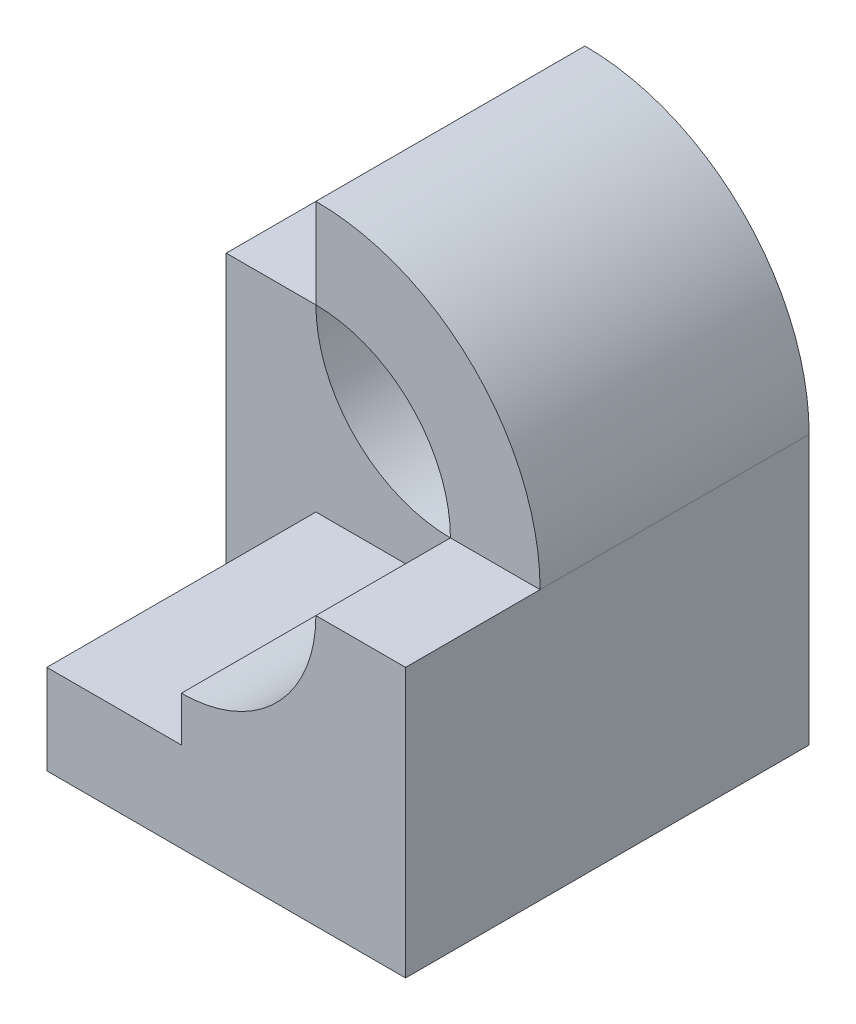
ISO-10303-21;
HEADER;
FILE_DESCRIPTION(('STEP AP214'),'2;1');
FILE_NAME('part.step','',(''),(''),'','','');
FILE_SCHEMA(('AUTOMOTIVE_DESIGN { 1 0 10303 214 1 1 1 1 }'));
ENDSEC;
DATA;
#1=APPLICATION_CONTEXT('core data for automotive mechanical design processes');
#2=APPLICATION_PROTOCOL_DEFINITION('international standard','automotive_design',2000,#1);
#3=PRODUCT_CONTEXT('',#1,'mechanical');
#4=PRODUCT('Part','Part','',(#3));
#5=PRODUCT_RELATED_PRODUCT_CATEGORY('part','',(#4));
#6=PRODUCT_DEFINITION_FORMATION('','',#4);
#7=PRODUCT_DEFINITION_CONTEXT('part definition',#1,'design');
#8=PRODUCT_DEFINITION('design','',#6,#7);
#9=PRODUCT_DEFINITION_SHAPE('','',#8);
#10=(LENGTH_UNIT() NAMED_UNIT(*) SI_UNIT(.MILLI.,.METRE.));
#11=(NAMED_UNIT(*) PLANE_ANGLE_UNIT() SI_UNIT($,.RADIAN.));
#12=(NAMED_UNIT(*) SI_UNIT($,.STERADIAN.) SOLID_ANGLE_UNIT());
#13=UNCERTAINTY_MEASURE_WITH_UNIT(LENGTH_MEASURE(1.E-05),#10,'distance_accuracy_value','');
#14=(GEOMETRIC_REPRESENTATION_CONTEXT(3) GLOBAL_UNCERTAINTY_ASSIGNED_CONTEXT((#13)) GLOBAL_UNIT_ASSIGNED_CONTEXT((#10,
#11,#12)) REPRESENTATION_CONTEXT('',''));
#15=CARTESIAN_POINT('',(0.,0.,0.));
#16=DIRECTION('',(0.,0.,1.));
#17=DIRECTION('',(1.,0.,0.));
#18=AXIS2_PLACEMENT_3D('',#15,#16,#17);
#19=CARTESIAN_POINT('',(5.,6.,9.));
#20=DIRECTION('',(0.,0.,-1.));
#21=DIRECTION('',(-1.,0.,0.));
#22=AXIS2_PLACEMENT_3D('',#19,#20,#21);
#23=CYLINDRICAL_SURFACE('',#22,5.);
#24=CARTESIAN_POINT('',(5.,6.,6.));
#25=DIRECTION('',(0.,0.,1.));
#26=DIRECTION('',(1.,0.,0.));
#27=AXIS2_PLACEMENT_3D('',#24,#25,#26);
#28=CIRCLE('',#27,5.);
#29=CARTESIAN_POINT('',(10.,6.,6.));
#30=VERTEX_POINT('',#29);
#31=CARTESIAN_POINT('',(4.99999999999998,11.,6.));
#32=VERTEX_POINT('',#31);
#33=EDGE_CURVE('E198',#30,#32,#28,.T.);
#34=ORIENTED_EDGE('',*,*,#33,.F.);
#35=DIRECTION('',(0.,0.,-1.));
#36=VECTOR('',#35,1.);
#37=CARTESIAN_POINT('',(10.,6.,9.));
#38=LINE('',#37,#36);
#39=CARTESIAN_POINT('',(10.,6.,0.));
#40=VERTEX_POINT('',#39);
#41=EDGE_CURVE('E168',#30,#40,#38,.T.);
#42=ORIENTED_EDGE('',*,*,#41,.T.);
#43=CARTESIAN_POINT('',(5.,6.,0.));
#44=DIRECTION('',(0.,0.,1.));
#45=DIRECTION('',(1.,0.,0.));
#46=AXIS2_PLACEMENT_3D('',#43,#44,#45);
#47=CIRCLE('',#46,5.);
#48=CARTESIAN_POINT('',(5.,11.,0.));
#49=VERTEX_POINT('',#48);
#50=EDGE_CURVE('E196',#40,#49,#47,.T.);
#51=ORIENTED_EDGE('',*,*,#50,.T.);
#52=DIRECTION('',(0.,0.,-1.));
#53=VECTOR('',#52,1.);
#54=CARTESIAN_POINT('',(5.,11.,9.));
#55=LINE('',#54,#53);
#56=EDGE_CURVE('E166',#32,#49,#55,.T.);
#57=ORIENTED_EDGE('',*,*,#56,.F.);
#58=EDGE_LOOP('',(#34,#42,#51,#57));
#59=FACE_BOUND('',#58,.T.);
#60=ADVANCED_FACE('F35',(#59),#23,.T.);
#61=CARTESIAN_POINT('',(5.,0.,9.));
#62=DIRECTION('',(1.,0.,0.));
#63=DIRECTION('',(0.,0.,-1.));
#64=AXIS2_PLACEMENT_3D('',#61,#62,#63);
#65=PLANE('',#64);
#66=DIRECTION('',(0.,-1.,0.));
#67=VECTOR('',#66,1.);
#68=CARTESIAN_POINT('',(4.99999999999998,11.,6.));
#69=LINE('',#68,#67);
#70=CARTESIAN_POINT('',(4.99999999999998,9.,6.));
#71=VERTEX_POINT('',#70);
#72=EDGE_CURVE('E225',#32,#71,#69,.T.);
#73=ORIENTED_EDGE('',*,*,#72,.F.);
#74=ORIENTED_EDGE('',*,*,#56,.T.);
#75=DIRECTION('',(0.,-1.,0.));
#76=VECTOR('',#75,1.);
#77=CARTESIAN_POINT('',(5.,0.,0.));
#78=LINE('',#77,#76);
#79=CARTESIAN_POINT('',(5.,9.,0.));
#80=VERTEX_POINT('',#79);
#81=EDGE_CURVE('E203',#49,#80,#78,.T.);
#82=ORIENTED_EDGE('',*,*,#81,.T.);
#83=DIRECTION('',(0.,0.,-1.));
#84=VECTOR('',#83,1.);
#85=CARTESIAN_POINT('',(5.,9.,9.));
#86=LINE('',#85,#84);
#87=EDGE_CURVE('E164',#71,#80,#86,.T.);
#88=ORIENTED_EDGE('',*,*,#87,.F.);
#89=EDGE_LOOP('',(#73,#74,#82,#88));
#90=FACE_BOUND('',#89,.T.);
#91=ADVANCED_FACE('F224',(#90),#65,.F.);
#92=CARTESIAN_POINT('',(10.,0.,9.));
#93=DIRECTION('',(-1.,0.,0.));
#94=DIRECTION('',(0.,0.,1.));
#95=AXIS2_PLACEMENT_3D('',#92,#93,#94);
#96=PLANE('',#95);
#97=DIRECTION('',(0.,1.,0.));
#98=VECTOR('',#97,1.);
#99=CARTESIAN_POINT('',(10.,0.,0.));
#100=LINE('',#99,#98);
#101=CARTESIAN_POINT('',(10.,0.,0.));
#102=VERTEX_POINT('',#101);
#103=EDGE_CURVE('E191',#102,#40,#100,.T.);
#104=ORIENTED_EDGE('',*,*,#103,.T.);
#105=ORIENTED_EDGE('',*,*,#41,.F.);
#106=CARTESIAN_POINT('',(10.,6.,9.));
#107=VERTEX_POINT('',#106);
#108=EDGE_CURVE('E169',#107,#30,#38,.T.);
#109=ORIENTED_EDGE('',*,*,#108,.F.);
#110=DIRECTION('',(0.,1.,0.));
#111=VECTOR('',#110,1.);
#112=CARTESIAN_POINT('',(10.,0.,9.));
#113=LINE('',#112,#111);
#114=CARTESIAN_POINT('',(10.,0.,9.));
#115=VERTEX_POINT('',#114);
#116=EDGE_CURVE('E181',#115,#107,#113,.T.);
#117=ORIENTED_EDGE('',*,*,#116,.F.);
#118=DIRECTION('',(0.,0.,-1.));
#119=VECTOR('',#118,1.);
#120=CARTESIAN_POINT('',(10.,0.,9.));
#121=LINE('',#120,#119);
#122=EDGE_CURVE('E154',#115,#102,#121,.T.);
#123=ORIENTED_EDGE('',*,*,#122,.T.);
#124=EDGE_LOOP('',(#104,#105,#109,#117,#123));
#125=FACE_BOUND('',#124,.T.);
#126=ADVANCED_FACE('F37',(#125),#96,.F.);
#127=CARTESIAN_POINT('',(5.,6.,9.));
#128=DIRECTION('',(0.,0.,-1.));
#129=DIRECTION('',(-1.,0.,0.));
#130=AXIS2_PLACEMENT_3D('',#127,#128,#129);
#131=CYLINDRICAL_SURFACE('',#130,3.);
#132=DIRECTION('',(0.,0.,1.));
#133=VECTOR('',#132,1.);
#134=CARTESIAN_POINT('',(5.,3.,3.));
#135=LINE('',#134,#133);
#136=CARTESIAN_POINT('',(5.,3.,3.));
#137=VERTEX_POINT('',#136);
#138=CARTESIAN_POINT('',(5.,3.,9.));
#139=VERTEX_POINT('',#138);
#140=EDGE_CURVE('E371',#137,#139,#135,.T.);
#141=ORIENTED_EDGE('',*,*,#140,.T.);
#142=CARTESIAN_POINT('',(5.,6.,9.));
#143=DIRECTION('',(0.,0.,1.));
#144=DIRECTION('',(1.,0.,0.));
#145=AXIS2_PLACEMENT_3D('',#142,#143,#144);
#146=CIRCLE('',#145,3.);
#147=CARTESIAN_POINT('',(8.,6.,9.));
#148=VERTEX_POINT('',#147);
#149=EDGE_CURVE('E58',#139,#148,#146,.T.);
#150=ORIENTED_EDGE('',*,*,#149,.T.);
#151=DIRECTION('',(0.,0.,-1.));
#152=VECTOR('',#151,1.);
#153=CARTESIAN_POINT('',(8.,6.,9.));
#154=LINE('',#153,#152);
#155=CARTESIAN_POINT('',(8.,6.,6.));
#156=VERTEX_POINT('',#155);
#157=EDGE_CURVE('E178',#156,#148,#154,.F.);
#158=ORIENTED_EDGE('',*,*,#157,.F.);
#159=CARTESIAN_POINT('',(5.,6.,6.));
#160=DIRECTION('',(0.,0.,1.));
#161=DIRECTION('',(1.,0.,0.));
#162=AXIS2_PLACEMENT_3D('',#159,#160,#161);
#163=CIRCLE('',#162,3.);
#164=EDGE_CURVE('E11',#156,#71,#163,.T.);
#165=ORIENTED_EDGE('',*,*,#164,.T.);
#166=ORIENTED_EDGE('',*,*,#87,.T.);
#167=CARTESIAN_POINT('',(5.,6.,0.));
#168=DIRECTION('',(0.,0.,1.));
#169=DIRECTION('',(1.,0.,0.));
#170=AXIS2_PLACEMENT_3D('',#167,#168,#169);
#171=CIRCLE('',#170,3.);
#172=CARTESIAN_POINT('',(2.,6.,0.));
#173=VERTEX_POINT('',#172);
#174=EDGE_CURVE('E205',#173,#80,#171,.T.);
#175=ORIENTED_EDGE('',*,*,#174,.F.);
#176=DIRECTION('',(0.,0.,-1.));
#177=VECTOR('',#176,1.);
#178=CARTESIAN_POINT('',(2.,6.,9.));
#179=LINE('',#178,#177);
#180=CARTESIAN_POINT('',(2.,6.,3.));
#181=VERTEX_POINT('',#180);
#182=EDGE_CURVE('E156',#181,#173,#179,.T.);
#183=ORIENTED_EDGE('',*,*,#182,.F.);
#184=CARTESIAN_POINT('',(5.,6.,3.));
#185=DIRECTION('',(0.,0.,-1.));
#186=DIRECTION('',(-1.,0.,0.));
#187=AXIS2_PLACEMENT_3D('',#184,#185,#186);
#188=CIRCLE('',#187,3.);
#189=EDGE_CURVE('E228',#137,#181,#188,.T.);
#190=ORIENTED_EDGE('',*,*,#189,.F.);
#191=EDGE_LOOP('',(#141,#150,#158,#165,#166,#175,#183,#190));
#192=FACE_BOUND('',#191,.T.);
#193=ADVANCED_FACE('F220',(#192),#131,.F.);
#194=CARTESIAN_POINT('',(0.,6.,9.));
#195=DIRECTION('',(0.,1.,0.));
#196=DIRECTION('',(0.,0.,1.));
#197=AXIS2_PLACEMENT_3D('',#194,#195,#196);
#198=PLANE('',#197);
#199=DIRECTION('',(-1.,0.,0.));
#200=VECTOR('',#199,1.);
#201=CARTESIAN_POINT('',(0.,6.,3.));
#202=LINE('',#201,#200);
#203=CARTESIAN_POINT('',(0.,6.,3.));
#204=VERTEX_POINT('',#203);
#205=EDGE_CURVE('E136',#181,#204,#202,.T.);
#206=ORIENTED_EDGE('',*,*,#205,.F.);
#207=ORIENTED_EDGE('',*,*,#182,.T.);
#208=DIRECTION('',(1.,0.,0.));
#209=VECTOR('',#208,1.);
#210=CARTESIAN_POINT('',(0.,6.,0.));
#211=LINE('',#210,#209);
#212=CARTESIAN_POINT('',(0.,6.,0.));
#213=VERTEX_POINT('',#212);
#214=EDGE_CURVE('E211',#213,#173,#211,.T.);
#215=ORIENTED_EDGE('',*,*,#214,.F.);
#216=DIRECTION('',(0.,0.,-1.));
#217=VECTOR('',#216,1.);
#218=CARTESIAN_POINT('',(0.,6.,9.));
#219=LINE('',#218,#217);
#220=EDGE_CURVE('E153',#204,#213,#219,.T.);
#221=ORIENTED_EDGE('',*,*,#220,.F.);
#222=EDGE_LOOP('',(#206,#207,#215,#221));
#223=FACE_BOUND('',#222,.T.);
#224=ADVANCED_FACE('F217',(#223),#198,.T.);
#225=CARTESIAN_POINT('',(0.,0.,9.));
#226=DIRECTION('',(-1.,0.,0.));
#227=DIRECTION('',(0.,0.,1.));
#228=AXIS2_PLACEMENT_3D('',#225,#226,#227);
#229=PLANE('',#228);
#230=DIRECTION('',(0.,-1.,0.));
#231=VECTOR('',#230,1.);
#232=CARTESIAN_POINT('',(0.,0.,3.));
#233=LINE('',#232,#231);
#234=CARTESIAN_POINT('',(0.,0.,3.));
#235=VERTEX_POINT('',#234);
#236=EDGE_CURVE('E130',#204,#235,#233,.T.);
#237=ORIENTED_EDGE('',*,*,#236,.F.);
#238=ORIENTED_EDGE('',*,*,#220,.T.);
#239=DIRECTION('',(0.,1.,0.));
#240=VECTOR('',#239,1.);
#241=CARTESIAN_POINT('',(0.,0.,0.));
#242=LINE('',#241,#240);
#243=CARTESIAN_POINT('',(0.,0.,0.));
#244=VERTEX_POINT('',#243);
#245=EDGE_CURVE('E152',#244,#213,#242,.T.);
#246=ORIENTED_EDGE('',*,*,#245,.F.);
#247=DIRECTION('',(0.,0.,-1.));
#248=VECTOR('',#247,1.);
#249=CARTESIAN_POINT('',(0.,0.,9.));
#250=LINE('',#249,#248);
#251=EDGE_CURVE('E145',#235,#244,#250,.T.);
#252=ORIENTED_EDGE('',*,*,#251,.F.);
#253=EDGE_LOOP('',(#237,#238,#246,#252));
#254=FACE_BOUND('',#253,.T.);
#255=ADVANCED_FACE('F150',(#254),#229,.T.);
#256=CARTESIAN_POINT('',(0.,0.,9.));
#257=DIRECTION('',(0.,1.,0.));
#258=DIRECTION('',(0.,0.,1.));
#259=AXIS2_PLACEMENT_3D('',#256,#257,#258);
#260=PLANE('',#259);
#261=DIRECTION('',(1.,0.,0.));
#262=VECTOR('',#261,1.);
#263=CARTESIAN_POINT('',(0.,0.,9.));
#264=LINE('',#263,#262);
#265=CARTESIAN_POINT('',(2.,0.,9.));
#266=VERTEX_POINT('',#265);
#267=EDGE_CURVE('E159',#266,#115,#264,.T.);
#268=ORIENTED_EDGE('',*,*,#267,.F.);
#269=DIRECTION('',(0.,0.,1.));
#270=VECTOR('',#269,1.);
#271=CARTESIAN_POINT('',(2.,0.,3.));
#272=LINE('',#271,#270);
#273=CARTESIAN_POINT('',(2.,0.,3.));
#274=VERTEX_POINT('',#273);
#275=EDGE_CURVE('E50',#274,#266,#272,.T.);
#276=ORIENTED_EDGE('',*,*,#275,.F.);
#277=DIRECTION('',(1.,0.,0.));
#278=VECTOR('',#277,1.);
#279=CARTESIAN_POINT('',(2.,0.,3.));
#280=LINE('',#279,#278);
#281=EDGE_CURVE('E134',#235,#274,#280,.T.);
#282=ORIENTED_EDGE('',*,*,#281,.F.);
#283=ORIENTED_EDGE('',*,*,#251,.T.);
#284=DIRECTION('',(1.,0.,0.));
#285=VECTOR('',#284,1.);
#286=CARTESIAN_POINT('',(0.,0.,0.));
#287=LINE('',#286,#285);
#288=EDGE_CURVE('E186',#244,#102,#287,.T.);
#289=ORIENTED_EDGE('',*,*,#288,.T.);
#290=ORIENTED_EDGE('',*,*,#122,.F.);
#291=EDGE_LOOP('',(#268,#276,#282,#283,#289,#290));
#292=FACE_BOUND('',#291,.T.);
#293=ADVANCED_FACE('F144',(#292),#260,.F.);
#294=CARTESIAN_POINT('',(0.,0.,9.));
#295=DIRECTION('',(0.,0.,1.));
#296=DIRECTION('',(1.,0.,0.));
#297=AXIS2_PLACEMENT_3D('',#294,#295,#296);
#298=PLANE('',#297);
#299=DIRECTION('',(0.,1.,0.));
#300=VECTOR('',#299,1.);
#301=CARTESIAN_POINT('',(5.,3.,9.));
#302=LINE('',#301,#300);
#303=CARTESIAN_POINT('',(5.,2.,9.));
#304=VERTEX_POINT('',#303);
#305=EDGE_CURVE('E140',#304,#139,#302,.T.);
#306=ORIENTED_EDGE('',*,*,#305,.F.);
#307=DIRECTION('',(1.,0.,0.));
#308=VECTOR('',#307,1.);
#309=CARTESIAN_POINT('',(5.,2.,9.));
#310=LINE('',#309,#308);
#311=CARTESIAN_POINT('',(2.,2.,9.));
#312=VERTEX_POINT('',#311);
#313=EDGE_CURVE('E364',#312,#304,#310,.T.);
#314=ORIENTED_EDGE('',*,*,#313,.F.);
#315=DIRECTION('',(0.,1.,0.));
#316=VECTOR('',#315,1.);
#317=CARTESIAN_POINT('',(2.,2.,9.));
#318=LINE('',#317,#316);
#319=EDGE_CURVE('E360',#266,#312,#318,.T.);
#320=ORIENTED_EDGE('',*,*,#319,.F.);
#321=ORIENTED_EDGE('',*,*,#267,.T.);
#322=ORIENTED_EDGE('',*,*,#116,.T.);
#323=DIRECTION('',(1.,0.,0.));
#324=VECTOR('',#323,1.);
#325=CARTESIAN_POINT('',(0.,6.,9.));
#326=LINE('',#325,#324);
#327=EDGE_CURVE('E43',#148,#107,#326,.T.);
#328=ORIENTED_EDGE('',*,*,#327,.F.);
#329=ORIENTED_EDGE('',*,*,#149,.F.);
#330=EDGE_LOOP('',(#306,#314,#320,#321,#322,#328,#329));
#331=FACE_BOUND('',#330,.T.);
#332=ADVANCED_FACE('F183',(#331),#298,.T.);
#333=CARTESIAN_POINT('',(0.,0.,0.));
#334=DIRECTION('',(0.,0.,1.));
#335=DIRECTION('',(1.,0.,0.));
#336=AXIS2_PLACEMENT_3D('',#333,#334,#335);
#337=PLANE('',#336);
#338=ORIENTED_EDGE('',*,*,#103,.F.);
#339=ORIENTED_EDGE('',*,*,#288,.F.);
#340=ORIENTED_EDGE('',*,*,#245,.T.);
#341=ORIENTED_EDGE('',*,*,#214,.T.);
#342=ORIENTED_EDGE('',*,*,#174,.T.);
#343=ORIENTED_EDGE('',*,*,#81,.F.);
#344=ORIENTED_EDGE('',*,*,#50,.F.);
#345=EDGE_LOOP('',(#338,#339,#340,#341,#342,#343,#344));
#346=FACE_BOUND('',#345,.T.);
#347=ADVANCED_FACE('F200',(#346),#337,.F.);
#348=CARTESIAN_POINT('',(0.,0.,6.));
#349=DIRECTION('',(0.,0.,1.));
#350=DIRECTION('',(1.,0.,0.));
#351=AXIS2_PLACEMENT_3D('',#348,#349,#350);
#352=PLANE('',#351);
#353=ORIENTED_EDGE('',*,*,#33,.T.);
#354=ORIENTED_EDGE('',*,*,#72,.T.);
#355=ORIENTED_EDGE('',*,*,#164,.F.);
#356=DIRECTION('',(1.,0.,0.));
#357=VECTOR('',#356,1.);
#358=CARTESIAN_POINT('',(4.99999999999998,6.,6.));
#359=LINE('',#358,#357);
#360=EDGE_CURVE('E227',#156,#30,#359,.T.);
#361=ORIENTED_EDGE('',*,*,#360,.T.);
#362=EDGE_LOOP('',(#353,#354,#355,#361));
#363=FACE_BOUND('',#362,.T.);
#364=ADVANCED_FACE('F236',(#363),#352,.T.);
#365=CARTESIAN_POINT('',(4.99999999999998,6.,6.));
#366=DIRECTION('',(0.,-1.,0.));
#367=DIRECTION('',(0.,0.,-1.));
#368=AXIS2_PLACEMENT_3D('',#365,#366,#367);
#369=PLANE('',#368);
#370=ORIENTED_EDGE('',*,*,#157,.T.);
#371=ORIENTED_EDGE('',*,*,#327,.T.);
#372=ORIENTED_EDGE('',*,*,#108,.T.);
#373=ORIENTED_EDGE('',*,*,#360,.F.);
#374=EDGE_LOOP('',(#370,#371,#372,#373));
#375=FACE_BOUND('',#374,.T.);
#376=ADVANCED_FACE('F174',(#375),#369,.F.);
#377=CARTESIAN_POINT('',(5.,3.,3.));
#378=DIRECTION('',(1.,0.,0.));
#379=DIRECTION('',(0.,1.,0.));
#380=AXIS2_PLACEMENT_3D('',#377,#378,#379);
#381=PLANE('',#380);
#382=ORIENTED_EDGE('',*,*,#305,.T.);
#383=ORIENTED_EDGE('',*,*,#140,.F.);
#384=DIRECTION('',(0.,1.,0.));
#385=VECTOR('',#384,1.);
#386=CARTESIAN_POINT('',(5.,3.,3.));
#387=LINE('',#386,#385);
#388=CARTESIAN_POINT('',(5.,2.,3.));
#389=VERTEX_POINT('',#388);
#390=EDGE_CURVE('E376',#389,#137,#387,.T.);
#391=ORIENTED_EDGE('',*,*,#390,.F.);
#392=DIRECTION('',(0.,0.,1.));
#393=VECTOR('',#392,1.);
#394=CARTESIAN_POINT('',(5.,2.,3.));
#395=LINE('',#394,#393);
#396=EDGE_CURVE('E373',#389,#304,#395,.T.);
#397=ORIENTED_EDGE('',*,*,#396,.T.);
#398=EDGE_LOOP('',(#382,#383,#391,#397));
#399=FACE_BOUND('',#398,.T.);
#400=ADVANCED_FACE('F243',(#399),#381,.F.);
#401=CARTESIAN_POINT('',(5.,2.,3.));
#402=DIRECTION('',(0.,-1.,0.));
#403=DIRECTION('',(1.,0.,0.));
#404=AXIS2_PLACEMENT_3D('',#401,#402,#403);
#405=PLANE('',#404);
#406=ORIENTED_EDGE('',*,*,#313,.T.);
#407=ORIENTED_EDGE('',*,*,#396,.F.);
#408=DIRECTION('',(1.,0.,0.));
#409=VECTOR('',#408,1.);
#410=CARTESIAN_POINT('',(5.,2.,3.));
#411=LINE('',#410,#409);
#412=CARTESIAN_POINT('',(2.,2.,3.));
#413=VERTEX_POINT('',#412);
#414=EDGE_CURVE('E378',#413,#389,#411,.T.);
#415=ORIENTED_EDGE('',*,*,#414,.F.);
#416=DIRECTION('',(0.,0.,1.));
#417=VECTOR('',#416,1.);
#418=CARTESIAN_POINT('',(2.,2.,3.));
#419=LINE('',#418,#417);
#420=EDGE_CURVE('E362',#413,#312,#419,.T.);
#421=ORIENTED_EDGE('',*,*,#420,.T.);
#422=EDGE_LOOP('',(#406,#407,#415,#421));
#423=FACE_BOUND('',#422,.T.);
#424=ADVANCED_FACE('F330',(#423),#405,.F.);
#425=CARTESIAN_POINT('',(2.,2.,3.));
#426=DIRECTION('',(1.,0.,0.));
#427=DIRECTION('',(0.,1.,0.));
#428=AXIS2_PLACEMENT_3D('',#425,#426,#427);
#429=PLANE('',#428);
#430=ORIENTED_EDGE('',*,*,#319,.T.);
#431=ORIENTED_EDGE('',*,*,#420,.F.);
#432=DIRECTION('',(0.,1.,0.));
#433=VECTOR('',#432,1.);
#434=CARTESIAN_POINT('',(2.,2.,3.));
#435=LINE('',#434,#433);
#436=EDGE_CURVE('E147',#274,#413,#435,.T.);
#437=ORIENTED_EDGE('',*,*,#436,.F.);
#438=ORIENTED_EDGE('',*,*,#275,.T.);
#439=EDGE_LOOP('',(#430,#431,#437,#438));
#440=FACE_BOUND('',#439,.T.);
#441=ADVANCED_FACE('F337',(#440),#429,.F.);
#442=CARTESIAN_POINT('',(0.,0.,3.));
#443=DIRECTION('',(0.,0.,-1.));
#444=DIRECTION('',(-1.,0.,0.));
#445=AXIS2_PLACEMENT_3D('',#442,#443,#444);
#446=PLANE('',#445);
#447=ORIENTED_EDGE('',*,*,#189,.T.);
#448=ORIENTED_EDGE('',*,*,#205,.T.);
#449=ORIENTED_EDGE('',*,*,#236,.T.);
#450=ORIENTED_EDGE('',*,*,#281,.T.);
#451=ORIENTED_EDGE('',*,*,#436,.T.);
#452=ORIENTED_EDGE('',*,*,#414,.T.);
#453=ORIENTED_EDGE('',*,*,#390,.T.);
#454=EDGE_LOOP('',(#447,#448,#449,#450,#451,#452,#453));
#455=FACE_BOUND('',#454,.T.);
#456=ADVANCED_FACE('F132',(#455),#446,.F.);
#457=CLOSED_SHELL('',(#60,#91,#126,#193,#224,#255,#293,#332,#347,#364,#376,#400,#424,#441,#456));
#458=MANIFOLD_SOLID_BREP('B2',#457);
#459=ADVANCED_BREP_SHAPE_REPRESENTATION('',(#18,#458),#14);
#460=SHAPE_DEFINITION_REPRESENTATION(#9,#459);
ENDSEC;
END-ISO-10303-21;
